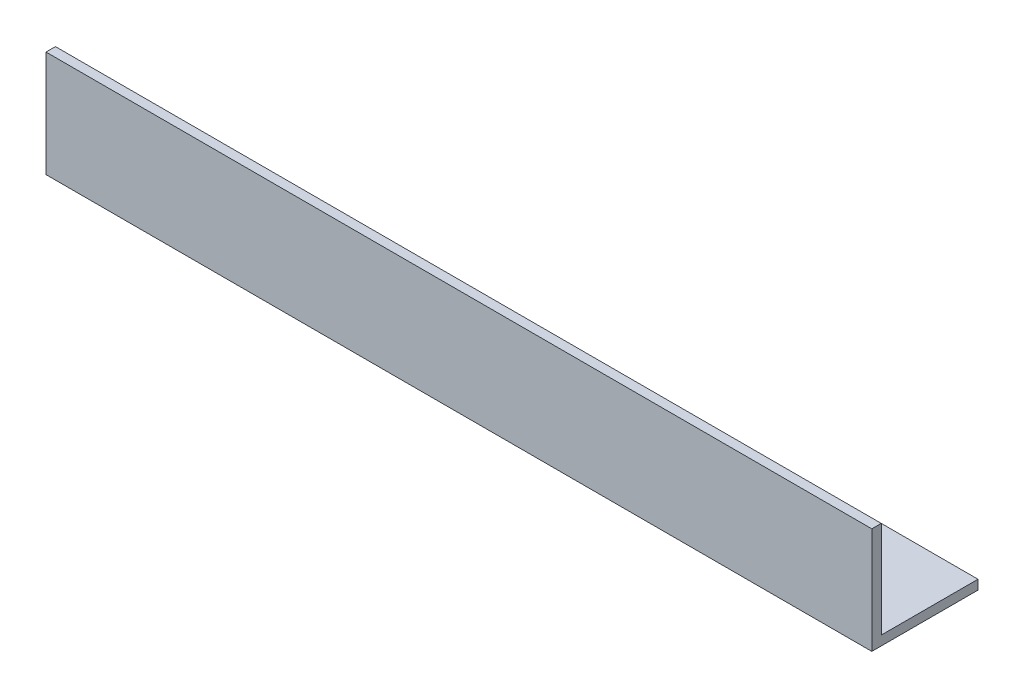
ISO-10303-21;
HEADER;
FILE_DESCRIPTION(('STEP AP214'),'2;1');
FILE_NAME('part.step','',(''),(''),'','','');
FILE_SCHEMA(('AUTOMOTIVE_DESIGN { 1 0 10303 214 1 1 1 1 }'));
ENDSEC;
DATA;
#1=APPLICATION_CONTEXT('core data for automotive mechanical design processes');
#2=APPLICATION_PROTOCOL_DEFINITION('international standard','automotive_design',2000,#1);
#3=PRODUCT_CONTEXT('',#1,'mechanical');
#4=PRODUCT('Part','Part','',(#3));
#5=PRODUCT_RELATED_PRODUCT_CATEGORY('part','',(#4));
#6=PRODUCT_DEFINITION_FORMATION('','',#4);
#7=PRODUCT_DEFINITION_CONTEXT('part definition',#1,'design');
#8=PRODUCT_DEFINITION('design','',#6,#7);
#9=PRODUCT_DEFINITION_SHAPE('','',#8);
#10=(LENGTH_UNIT() NAMED_UNIT(*) SI_UNIT(.MILLI.,.METRE.));
#11=(NAMED_UNIT(*) PLANE_ANGLE_UNIT() SI_UNIT($,.RADIAN.));
#12=(NAMED_UNIT(*) SI_UNIT($,.STERADIAN.) SOLID_ANGLE_UNIT());
#13=UNCERTAINTY_MEASURE_WITH_UNIT(LENGTH_MEASURE(1.E-05),#10,'distance_accuracy_value','');
#14=(GEOMETRIC_REPRESENTATION_CONTEXT(3) GLOBAL_UNCERTAINTY_ASSIGNED_CONTEXT((#13)) GLOBAL_UNIT_ASSIGNED_CONTEXT((#10,
#11,#12)) REPRESENTATION_CONTEXT('',''));
#15=CARTESIAN_POINT('',(0.,0.,0.));
#16=DIRECTION('',(0.,0.,1.));
#17=DIRECTION('',(1.,0.,0.));
#18=AXIS2_PLACEMENT_3D('',#15,#16,#17);
#19=CARTESIAN_POINT('',(350.,0.,0.));
#20=DIRECTION('',(0.,1.,0.));
#21=DIRECTION('',(0.,0.,1.));
#22=AXIS2_PLACEMENT_3D('',#19,#20,#21);
#23=PLANE('',#22);
#24=DIRECTION('',(0.,0.,-1.));
#25=VECTOR('',#24,1.);
#26=CARTESIAN_POINT('',(0.,0.,0.));
#27=LINE('',#26,#25);
#28=CARTESIAN_POINT('',(0.,0.,0.));
#29=VERTEX_POINT('',#28);
#30=CARTESIAN_POINT('',(0.,0.,-45.));
#31=VERTEX_POINT('',#30);
#32=EDGE_CURVE('E117',#29,#31,#27,.T.);
#33=ORIENTED_EDGE('',*,*,#32,.T.);
#34=DIRECTION('',(-1.,0.,0.));
#35=VECTOR('',#34,1.);
#36=CARTESIAN_POINT('',(350.,0.,-45.));
#37=LINE('',#36,#35);
#38=CARTESIAN_POINT('',(350.,0.,-45.));
#39=VERTEX_POINT('',#38);
#40=EDGE_CURVE('E11',#39,#31,#37,.T.);
#41=ORIENTED_EDGE('',*,*,#40,.F.);
#42=DIRECTION('',(0.,0.,-1.));
#43=VECTOR('',#42,1.);
#44=CARTESIAN_POINT('',(350.,0.,0.));
#45=LINE('',#44,#43);
#46=CARTESIAN_POINT('',(350.,0.,0.));
#47=VERTEX_POINT('',#46);
#48=EDGE_CURVE('E82',#47,#39,#45,.T.);
#49=ORIENTED_EDGE('',*,*,#48,.F.);
#50=DIRECTION('',(-1.,0.,0.));
#51=VECTOR('',#50,1.);
#52=CARTESIAN_POINT('',(350.,0.,0.));
#53=LINE('',#52,#51);
#54=EDGE_CURVE('E113',#47,#29,#53,.T.);
#55=ORIENTED_EDGE('',*,*,#54,.T.);
#56=EDGE_LOOP('',(#33,#41,#49,#55));
#57=FACE_BOUND('',#56,.T.);
#58=ADVANCED_FACE('F36',(#57),#23,.F.);
#59=CARTESIAN_POINT('',(350.,4.,-45.));
#60=DIRECTION('',(0.,0.,-1.));
#61=DIRECTION('',(-1.,0.,0.));
#62=AXIS2_PLACEMENT_3D('',#59,#60,#61);
#63=PLANE('',#62);
#64=DIRECTION('',(0.,-1.,0.));
#65=VECTOR('',#64,1.);
#66=CARTESIAN_POINT('',(0.,4.,-45.));
#67=LINE('',#66,#65);
#68=CARTESIAN_POINT('',(0.,4.,-45.));
#69=VERTEX_POINT('',#68);
#70=EDGE_CURVE('E120',#69,#31,#67,.T.);
#71=ORIENTED_EDGE('',*,*,#70,.F.);
#72=DIRECTION('',(-1.,0.,0.));
#73=VECTOR('',#72,1.);
#74=CARTESIAN_POINT('',(350.,4.,-45.));
#75=LINE('',#74,#73);
#76=CARTESIAN_POINT('',(350.,4.,-45.));
#77=VERTEX_POINT('',#76);
#78=EDGE_CURVE('E44',#77,#69,#75,.T.);
#79=ORIENTED_EDGE('',*,*,#78,.F.);
#80=DIRECTION('',(0.,-1.,0.));
#81=VECTOR('',#80,1.);
#82=CARTESIAN_POINT('',(350.,4.,-45.));
#83=LINE('',#82,#81);
#84=EDGE_CURVE('E206',#77,#39,#83,.T.);
#85=ORIENTED_EDGE('',*,*,#84,.T.);
#86=ORIENTED_EDGE('',*,*,#40,.T.);
#87=EDGE_LOOP('',(#71,#79,#85,#86));
#88=FACE_BOUND('',#87,.T.);
#89=ADVANCED_FACE('F138',(#88),#63,.T.);
#90=CARTESIAN_POINT('',(350.,4.,0.));
#91=DIRECTION('',(0.,1.,0.));
#92=DIRECTION('',(0.,0.,1.));
#93=AXIS2_PLACEMENT_3D('',#90,#91,#92);
#94=PLANE('',#93);
#95=DIRECTION('',(0.,0.,-1.));
#96=VECTOR('',#95,1.);
#97=CARTESIAN_POINT('',(0.,4.,0.));
#98=LINE('',#97,#96);
#99=CARTESIAN_POINT('',(0.,4.,-4.));
#100=VERTEX_POINT('',#99);
#101=EDGE_CURVE('E123',#100,#69,#98,.T.);
#102=ORIENTED_EDGE('',*,*,#101,.F.);
#103=DIRECTION('',(-1.,0.,0.));
#104=VECTOR('',#103,1.);
#105=CARTESIAN_POINT('',(350.,4.,-4.));
#106=LINE('',#105,#104);
#107=CARTESIAN_POINT('',(350.,4.,-4.));
#108=VERTEX_POINT('',#107);
#109=EDGE_CURVE('E103',#108,#100,#106,.T.);
#110=ORIENTED_EDGE('',*,*,#109,.F.);
#111=DIRECTION('',(0.,0.,-1.));
#112=VECTOR('',#111,1.);
#113=CARTESIAN_POINT('',(350.,4.,0.));
#114=LINE('',#113,#112);
#115=EDGE_CURVE('E109',#108,#77,#114,.T.);
#116=ORIENTED_EDGE('',*,*,#115,.T.);
#117=ORIENTED_EDGE('',*,*,#78,.T.);
#118=EDGE_LOOP('',(#102,#110,#116,#117));
#119=FACE_BOUND('',#118,.T.);
#120=ADVANCED_FACE('F135',(#119),#94,.T.);
#121=CARTESIAN_POINT('',(350.,45.,-4.));
#122=DIRECTION('',(0.,0.,-1.));
#123=DIRECTION('',(0.,1.,0.));
#124=AXIS2_PLACEMENT_3D('',#121,#122,#123);
#125=PLANE('',#124);
#126=DIRECTION('',(0.,-1.,0.));
#127=VECTOR('',#126,1.);
#128=CARTESIAN_POINT('',(0.,45.,-4.));
#129=LINE('',#128,#127);
#130=CARTESIAN_POINT('',(0.,45.,-4.));
#131=VERTEX_POINT('',#130);
#132=EDGE_CURVE('E98',#131,#100,#129,.T.);
#133=ORIENTED_EDGE('',*,*,#132,.F.);
#134=DIRECTION('',(-1.,0.,0.));
#135=VECTOR('',#134,1.);
#136=CARTESIAN_POINT('',(350.,45.,-4.));
#137=LINE('',#136,#135);
#138=CARTESIAN_POINT('',(350.,45.,-4.));
#139=VERTEX_POINT('',#138);
#140=EDGE_CURVE('E93',#139,#131,#137,.T.);
#141=ORIENTED_EDGE('',*,*,#140,.F.);
#142=DIRECTION('',(0.,-1.,0.));
#143=VECTOR('',#142,1.);
#144=CARTESIAN_POINT('',(350.,45.,-4.));
#145=LINE('',#144,#143);
#146=EDGE_CURVE('E96',#139,#108,#145,.T.);
#147=ORIENTED_EDGE('',*,*,#146,.T.);
#148=ORIENTED_EDGE('',*,*,#109,.T.);
#149=EDGE_LOOP('',(#133,#141,#147,#148));
#150=FACE_BOUND('',#149,.T.);
#151=ADVANCED_FACE('F95',(#150),#125,.T.);
#152=CARTESIAN_POINT('',(350.,45.,0.));
#153=DIRECTION('',(0.,1.,0.));
#154=DIRECTION('',(0.,0.,1.));
#155=AXIS2_PLACEMENT_3D('',#152,#153,#154);
#156=PLANE('',#155);
#157=DIRECTION('',(0.,0.,-1.));
#158=VECTOR('',#157,1.);
#159=CARTESIAN_POINT('',(0.,45.,0.));
#160=LINE('',#159,#158);
#161=CARTESIAN_POINT('',(0.,45.,0.));
#162=VERTEX_POINT('',#161);
#163=EDGE_CURVE('E127',#162,#131,#160,.T.);
#164=ORIENTED_EDGE('',*,*,#163,.F.);
#165=DIRECTION('',(-1.,0.,0.));
#166=VECTOR('',#165,1.);
#167=CARTESIAN_POINT('',(350.,45.,0.));
#168=LINE('',#167,#166);
#169=CARTESIAN_POINT('',(350.,45.,0.));
#170=VERTEX_POINT('',#169);
#171=EDGE_CURVE('E73',#170,#162,#168,.T.);
#172=ORIENTED_EDGE('',*,*,#171,.F.);
#173=DIRECTION('',(0.,0.,-1.));
#174=VECTOR('',#173,1.);
#175=CARTESIAN_POINT('',(350.,45.,0.));
#176=LINE('',#175,#174);
#177=EDGE_CURVE('E107',#170,#139,#176,.T.);
#178=ORIENTED_EDGE('',*,*,#177,.T.);
#179=ORIENTED_EDGE('',*,*,#140,.T.);
#180=EDGE_LOOP('',(#164,#172,#178,#179));
#181=FACE_BOUND('',#180,.T.);
#182=ADVANCED_FACE('F111',(#181),#156,.T.);
#183=CARTESIAN_POINT('',(350.,45.,0.));
#184=DIRECTION('',(0.,0.,-1.));
#185=DIRECTION('',(0.,1.,0.));
#186=AXIS2_PLACEMENT_3D('',#183,#184,#185);
#187=PLANE('',#186);
#188=DIRECTION('',(0.,-1.,0.));
#189=VECTOR('',#188,1.);
#190=CARTESIAN_POINT('',(0.,45.,0.));
#191=LINE('',#190,#189);
#192=EDGE_CURVE('E76',#162,#29,#191,.T.);
#193=ORIENTED_EDGE('',*,*,#192,.T.);
#194=ORIENTED_EDGE('',*,*,#54,.F.);
#195=DIRECTION('',(0.,-1.,0.));
#196=VECTOR('',#195,1.);
#197=CARTESIAN_POINT('',(350.,45.,0.));
#198=LINE('',#197,#196);
#199=EDGE_CURVE('E52',#170,#47,#198,.T.);
#200=ORIENTED_EDGE('',*,*,#199,.F.);
#201=ORIENTED_EDGE('',*,*,#171,.T.);
#202=EDGE_LOOP('',(#193,#194,#200,#201));
#203=FACE_BOUND('',#202,.T.);
#204=ADVANCED_FACE('F143',(#203),#187,.F.);
#205=CARTESIAN_POINT('',(350.,0.,0.));
#206=DIRECTION('',(-1.,0.,0.));
#207=DIRECTION('',(0.,0.,1.));
#208=AXIS2_PLACEMENT_3D('',#205,#206,#207);
#209=PLANE('',#208);
#210=ORIENTED_EDGE('',*,*,#48,.T.);
#211=ORIENTED_EDGE('',*,*,#84,.F.);
#212=ORIENTED_EDGE('',*,*,#115,.F.);
#213=ORIENTED_EDGE('',*,*,#146,.F.);
#214=ORIENTED_EDGE('',*,*,#177,.F.);
#215=ORIENTED_EDGE('',*,*,#199,.T.);
#216=EDGE_LOOP('',(#210,#211,#212,#213,#214,#215));
#217=FACE_BOUND('',#216,.T.);
#218=ADVANCED_FACE('F106',(#217),#209,.F.);
#219=CARTESIAN_POINT('',(0.,0.,0.));
#220=DIRECTION('',(-1.,0.,0.));
#221=DIRECTION('',(0.,0.,1.));
#222=AXIS2_PLACEMENT_3D('',#219,#220,#221);
#223=PLANE('',#222);
#224=ORIENTED_EDGE('',*,*,#32,.F.);
#225=ORIENTED_EDGE('',*,*,#192,.F.);
#226=ORIENTED_EDGE('',*,*,#163,.T.);
#227=ORIENTED_EDGE('',*,*,#132,.T.);
#228=ORIENTED_EDGE('',*,*,#101,.T.);
#229=ORIENTED_EDGE('',*,*,#70,.T.);
#230=EDGE_LOOP('',(#224,#225,#226,#227,#228,#229));
#231=FACE_BOUND('',#230,.T.);
#232=ADVANCED_FACE('F141',(#231),#223,.T.);
#233=CLOSED_SHELL('',(#58,#89,#120,#151,#182,#204,#218,#232));
#234=MANIFOLD_SOLID_BREP('B2',#233);
#235=ADVANCED_BREP_SHAPE_REPRESENTATION('',(#18,#234),#14);
#236=SHAPE_DEFINITION_REPRESENTATION(#9,#235);
ENDSEC;
END-ISO-10303-21;
